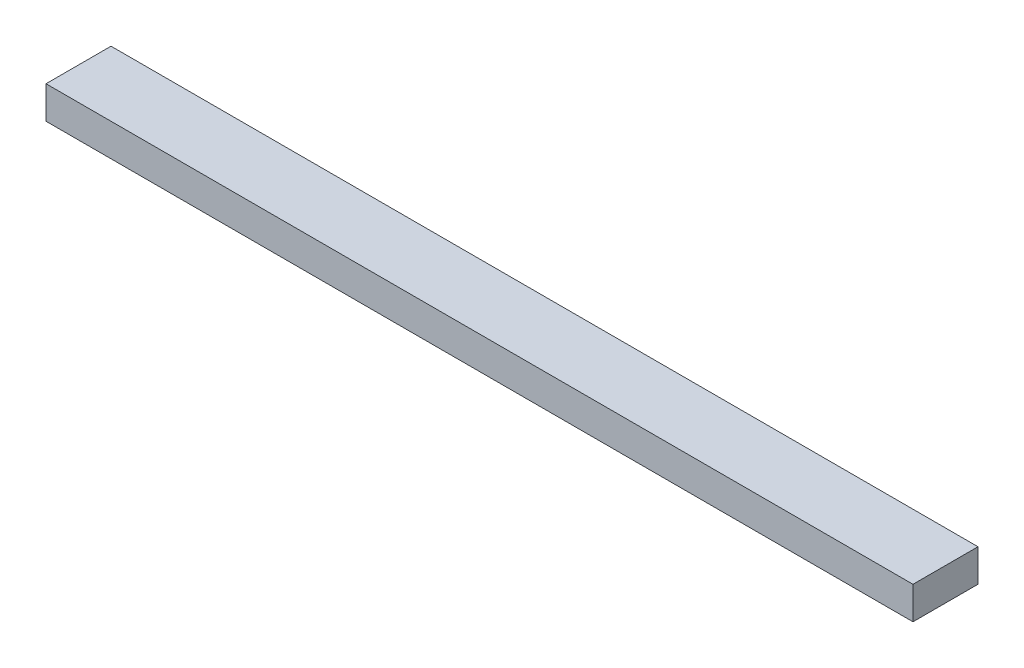
ISO-10303-21;
HEADER;
FILE_DESCRIPTION(('STEP AP214'),'2;1');
FILE_NAME('part.step','',(''),(''),'','','');
FILE_SCHEMA(('AUTOMOTIVE_DESIGN { 1 0 10303 214 1 1 1 1 }'));
ENDSEC;
DATA;
#1=APPLICATION_CONTEXT('core data for automotive mechanical design processes');
#2=APPLICATION_PROTOCOL_DEFINITION('international standard','automotive_design',2000,#1);
#3=PRODUCT_CONTEXT('',#1,'mechanical');
#4=PRODUCT('Part','Part','',(#3));
#5=PRODUCT_RELATED_PRODUCT_CATEGORY('part','',(#4));
#6=PRODUCT_DEFINITION_FORMATION('','',#4);
#7=PRODUCT_DEFINITION_CONTEXT('part definition',#1,'design');
#8=PRODUCT_DEFINITION('design','',#6,#7);
#9=PRODUCT_DEFINITION_SHAPE('','',#8);
#10=(LENGTH_UNIT() NAMED_UNIT(*) SI_UNIT(.MILLI.,.METRE.));
#11=(NAMED_UNIT(*) PLANE_ANGLE_UNIT() SI_UNIT($,.RADIAN.));
#12=(NAMED_UNIT(*) SI_UNIT($,.STERADIAN.) SOLID_ANGLE_UNIT());
#13=UNCERTAINTY_MEASURE_WITH_UNIT(LENGTH_MEASURE(1.E-05),#10,'distance_accuracy_value','');
#14=(GEOMETRIC_REPRESENTATION_CONTEXT(3) GLOBAL_UNCERTAINTY_ASSIGNED_CONTEXT((#13)) GLOBAL_UNIT_ASSIGNED_CONTEXT((#10,
#11,#12)) REPRESENTATION_CONTEXT('',''));
#15=CARTESIAN_POINT('',(0.,0.,0.));
#16=DIRECTION('',(0.,0.,1.));
#17=DIRECTION('',(1.,0.,0.));
#18=AXIS2_PLACEMENT_3D('',#15,#16,#17);
#19=CARTESIAN_POINT('',(0.,19.05,0.));
#20=DIRECTION('',(1.,0.,0.));
#21=DIRECTION('',(0.,0.,-1.));
#22=AXIS2_PLACEMENT_3D('',#19,#20,#21);
#23=PLANE('',#22);
#24=DIRECTION('',(0.,0.,1.));
#25=VECTOR('',#24,1.);
#26=CARTESIAN_POINT('',(0.,0.,0.));
#27=LINE('',#26,#25);
#28=CARTESIAN_POINT('',(0.,0.,-38.1));
#29=VERTEX_POINT('',#28);
#30=CARTESIAN_POINT('',(0.,0.,0.));
#31=VERTEX_POINT('',#30);
#32=EDGE_CURVE('E101',#29,#31,#27,.T.);
#33=ORIENTED_EDGE('',*,*,#32,.T.);
#34=DIRECTION('',(0.,-1.,0.));
#35=VECTOR('',#34,1.);
#36=CARTESIAN_POINT('',(0.,19.05,0.));
#37=LINE('',#36,#35);
#38=CARTESIAN_POINT('',(0.,19.05,0.));
#39=VERTEX_POINT('',#38);
#40=EDGE_CURVE('E11',#39,#31,#37,.T.);
#41=ORIENTED_EDGE('',*,*,#40,.F.);
#42=DIRECTION('',(0.,0.,1.));
#43=VECTOR('',#42,1.);
#44=CARTESIAN_POINT('',(0.,19.05,0.));
#45=LINE('',#44,#43);
#46=CARTESIAN_POINT('',(0.,19.05,-38.1));
#47=VERTEX_POINT('',#46);
#48=EDGE_CURVE('E89',#47,#39,#45,.T.);
#49=ORIENTED_EDGE('',*,*,#48,.F.);
#50=DIRECTION('',(0.,-1.,0.));
#51=VECTOR('',#50,1.);
#52=CARTESIAN_POINT('',(0.,19.05,-38.1));
#53=LINE('',#52,#51);
#54=EDGE_CURVE('E97',#47,#29,#53,.T.);
#55=ORIENTED_EDGE('',*,*,#54,.T.);
#56=EDGE_LOOP('',(#33,#41,#49,#55));
#57=FACE_BOUND('',#56,.T.);
#58=ADVANCED_FACE('F38',(#57),#23,.F.);
#59=CARTESIAN_POINT('',(0.,19.05,0.));
#60=DIRECTION('',(0.,0.,-1.));
#61=DIRECTION('',(-1.,0.,0.));
#62=AXIS2_PLACEMENT_3D('',#59,#60,#61);
#63=PLANE('',#62);
#64=DIRECTION('',(1.,0.,0.));
#65=VECTOR('',#64,1.);
#66=CARTESIAN_POINT('',(0.,0.,0.));
#67=LINE('',#66,#65);
#68=CARTESIAN_POINT('',(508.,0.,0.));
#69=VERTEX_POINT('',#68);
#70=EDGE_CURVE('E93',#31,#69,#67,.T.);
#71=ORIENTED_EDGE('',*,*,#70,.T.);
#72=DIRECTION('',(0.,-1.,0.));
#73=VECTOR('',#72,1.);
#74=CARTESIAN_POINT('',(508.,19.05,0.));
#75=LINE('',#74,#73);
#76=CARTESIAN_POINT('',(508.,19.05,0.));
#77=VERTEX_POINT('',#76);
#78=EDGE_CURVE('E46',#77,#69,#75,.T.);
#79=ORIENTED_EDGE('',*,*,#78,.F.);
#80=DIRECTION('',(1.,0.,0.));
#81=VECTOR('',#80,1.);
#82=CARTESIAN_POINT('',(0.,19.05,0.));
#83=LINE('',#82,#81);
#84=EDGE_CURVE('E84',#39,#77,#83,.T.);
#85=ORIENTED_EDGE('',*,*,#84,.F.);
#86=ORIENTED_EDGE('',*,*,#40,.T.);
#87=EDGE_LOOP('',(#71,#79,#85,#86));
#88=FACE_BOUND('',#87,.T.);
#89=ADVANCED_FACE('F92',(#88),#63,.F.);
#90=CARTESIAN_POINT('',(508.,19.05,0.));
#91=DIRECTION('',(-1.,0.,0.));
#92=DIRECTION('',(0.,0.,1.));
#93=AXIS2_PLACEMENT_3D('',#90,#91,#92);
#94=PLANE('',#93);
#95=DIRECTION('',(0.,0.,-1.));
#96=VECTOR('',#95,1.);
#97=CARTESIAN_POINT('',(508.,0.,0.));
#98=LINE('',#97,#96);
#99=CARTESIAN_POINT('',(508.,0.,-38.1));
#100=VERTEX_POINT('',#99);
#101=EDGE_CURVE('E71',#69,#100,#98,.T.);
#102=ORIENTED_EDGE('',*,*,#101,.T.);
#103=DIRECTION('',(0.,-1.,0.));
#104=VECTOR('',#103,1.);
#105=CARTESIAN_POINT('',(508.,19.05,-38.1));
#106=LINE('',#105,#104);
#107=CARTESIAN_POINT('',(508.,19.05,-38.1));
#108=VERTEX_POINT('',#107);
#109=EDGE_CURVE('E94',#108,#100,#106,.T.);
#110=ORIENTED_EDGE('',*,*,#109,.F.);
#111=DIRECTION('',(0.,0.,-1.));
#112=VECTOR('',#111,1.);
#113=CARTESIAN_POINT('',(508.,19.05,0.));
#114=LINE('',#113,#112);
#115=EDGE_CURVE('E87',#77,#108,#114,.T.);
#116=ORIENTED_EDGE('',*,*,#115,.F.);
#117=ORIENTED_EDGE('',*,*,#78,.T.);
#118=EDGE_LOOP('',(#102,#110,#116,#117));
#119=FACE_BOUND('',#118,.T.);
#120=ADVANCED_FACE('F95',(#119),#94,.F.);
#121=CARTESIAN_POINT('',(0.,19.05,-38.1));
#122=DIRECTION('',(0.,0.,1.));
#123=DIRECTION('',(1.,0.,0.));
#124=AXIS2_PLACEMENT_3D('',#121,#122,#123);
#125=PLANE('',#124);
#126=DIRECTION('',(-1.,0.,0.));
#127=VECTOR('',#126,1.);
#128=CARTESIAN_POINT('',(0.,0.,-38.1));
#129=LINE('',#128,#127);
#130=EDGE_CURVE('E77',#100,#29,#129,.T.);
#131=ORIENTED_EDGE('',*,*,#130,.T.);
#132=ORIENTED_EDGE('',*,*,#54,.F.);
#133=DIRECTION('',(-1.,0.,0.));
#134=VECTOR('',#133,1.);
#135=CARTESIAN_POINT('',(0.,19.05,-38.1));
#136=LINE('',#135,#134);
#137=EDGE_CURVE('E54',#108,#47,#136,.T.);
#138=ORIENTED_EDGE('',*,*,#137,.F.);
#139=ORIENTED_EDGE('',*,*,#109,.T.);
#140=EDGE_LOOP('',(#131,#132,#138,#139));
#141=FACE_BOUND('',#140,.T.);
#142=ADVANCED_FACE('F108',(#141),#125,.F.);
#143=CARTESIAN_POINT('',(0.,19.05,0.));
#144=DIRECTION('',(0.,-1.,0.));
#145=DIRECTION('',(0.,0.,-1.));
#146=AXIS2_PLACEMENT_3D('',#143,#144,#145);
#147=PLANE('',#146);
#148=ORIENTED_EDGE('',*,*,#48,.T.);
#149=ORIENTED_EDGE('',*,*,#84,.T.);
#150=ORIENTED_EDGE('',*,*,#115,.T.);
#151=ORIENTED_EDGE('',*,*,#137,.T.);
#152=EDGE_LOOP('',(#148,#149,#150,#151));
#153=FACE_BOUND('',#152,.T.);
#154=ADVANCED_FACE('F85',(#153),#147,.F.);
#155=CARTESIAN_POINT('',(0.,0.,0.));
#156=DIRECTION('',(0.,-1.,0.));
#157=DIRECTION('',(0.,0.,-1.));
#158=AXIS2_PLACEMENT_3D('',#155,#156,#157);
#159=PLANE('',#158);
#160=ORIENTED_EDGE('',*,*,#32,.F.);
#161=ORIENTED_EDGE('',*,*,#130,.F.);
#162=ORIENTED_EDGE('',*,*,#101,.F.);
#163=ORIENTED_EDGE('',*,*,#70,.F.);
#164=EDGE_LOOP('',(#160,#161,#162,#163));
#165=FACE_BOUND('',#164,.T.);
#166=ADVANCED_FACE('F111',(#165),#159,.T.);
#167=CLOSED_SHELL('',(#58,#89,#120,#142,#154,#166));
#168=MANIFOLD_SOLID_BREP('B2',#167);
#169=ADVANCED_BREP_SHAPE_REPRESENTATION('',(#18,#168),#14);
#170=SHAPE_DEFINITION_REPRESENTATION(#9,#169);
ENDSEC;
END-ISO-10303-21;
